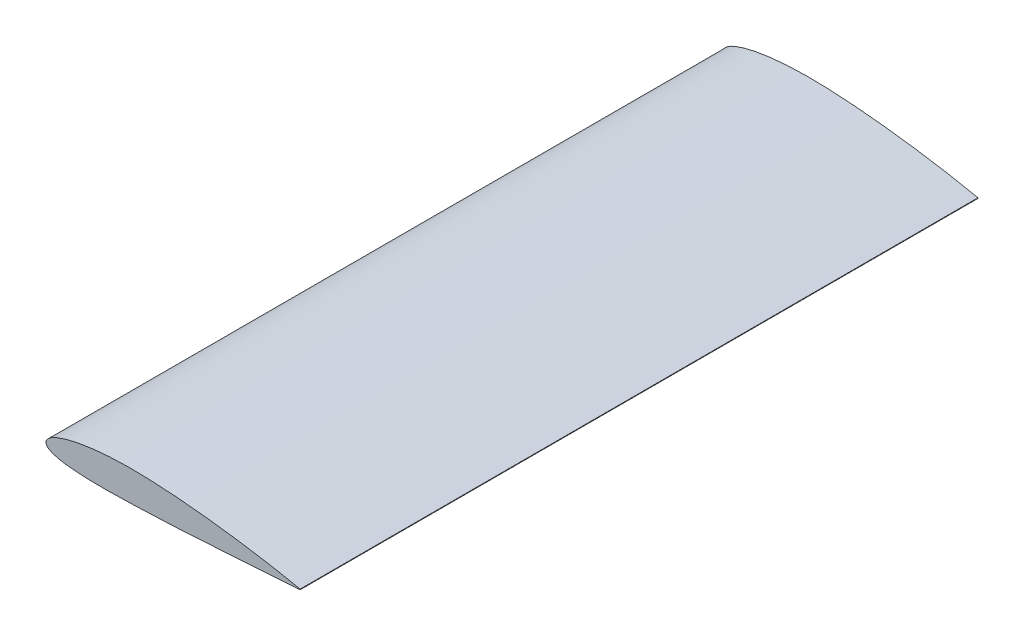
ISO-10303-21;
HEADER;
FILE_DESCRIPTION(('STEP AP214'),'2;1');
FILE_NAME('part.step','',(''),(''),'','','');
FILE_SCHEMA(('AUTOMOTIVE_DESIGN { 1 0 10303 214 1 1 1 1 }'));
ENDSEC;
DATA;
#1=APPLICATION_CONTEXT('core data for automotive mechanical design processes');
#2=APPLICATION_PROTOCOL_DEFINITION('international standard','automotive_design',2000,#1);
#3=PRODUCT_CONTEXT('',#1,'mechanical');
#4=PRODUCT('Part','Part','',(#3));
#5=PRODUCT_RELATED_PRODUCT_CATEGORY('part','',(#4));
#6=PRODUCT_DEFINITION_FORMATION('','',#4);
#7=PRODUCT_DEFINITION_CONTEXT('part definition',#1,'design');
#8=PRODUCT_DEFINITION('design','',#6,#7);
#9=PRODUCT_DEFINITION_SHAPE('','',#8);
#10=(LENGTH_UNIT() NAMED_UNIT(*) SI_UNIT(.MILLI.,.METRE.));
#11=(NAMED_UNIT(*) PLANE_ANGLE_UNIT() SI_UNIT($,.RADIAN.));
#12=(NAMED_UNIT(*) SI_UNIT($,.STERADIAN.) SOLID_ANGLE_UNIT());
#13=UNCERTAINTY_MEASURE_WITH_UNIT(LENGTH_MEASURE(1.E-05),#10,'distance_accuracy_value','');
#14=(GEOMETRIC_REPRESENTATION_CONTEXT(3) GLOBAL_UNCERTAINTY_ASSIGNED_CONTEXT((#13)) GLOBAL_UNIT_ASSIGNED_CONTEXT((#10,
#11,#12)) REPRESENTATION_CONTEXT('',''));
#15=CARTESIAN_POINT('',(0.,0.,0.));
#16=DIRECTION('',(0.,0.,1.));
#17=DIRECTION('',(1.,0.,0.));
#18=AXIS2_PLACEMENT_3D('',#15,#16,#17);
#19=CARTESIAN_POINT('',(1500.126,1.8855,2000.));
#20=CARTESIAN_POINT('',(1499.36250962682,2.04454622633905,2000.));
#21=CARTESIAN_POINT('',(1496.31288024535,2.6798286894732,2000.));
#22=CARTESIAN_POINT('',(1489.46815435767,4.10050468112612,2000.));
#23=CARTESIAN_POINT('',(1478.10424528291,6.43882842560711,2000.));
#24=CARTESIAN_POINT('',(1462.28588160738,9.64872347621278,2000.));
#25=CARTESIAN_POINT('',(1442.10650015217,13.6770674132571,2000.));
#26=CARTESIAN_POINT('',(1417.68261613177,18.4488091632932,2000.));
#27=CARTESIAN_POINT('',(1389.15763680456,23.8816251229395,2000.));
#28=CARTESIAN_POINT('',(1356.69951059212,29.8872262769183,2000.));
#29=CARTESIAN_POINT('',(1320.49931464965,36.3633785840388,2000.));
#30=CARTESIAN_POINT('',(1280.77334318009,43.2092253702978,2000.));
#31=CARTESIAN_POINT('',(1237.75828325618,50.3211496049656,2000.));
#32=CARTESIAN_POINT('',(1191.71219612801,57.5897056804869,2000.));
#33=CARTESIAN_POINT('',(1142.91266888195,64.9079515766165,2000.));
#34=CARTESIAN_POINT('',(1091.65650349491,72.1707843166536,2000.));
#35=CARTESIAN_POINT('',(1038.25529393639,79.2693300204012,2000.));
#36=CARTESIAN_POINT('',(983.03553107897,86.0985567611147,2000.));
#37=CARTESIAN_POINT('',(926.33636880365,92.560783205146,2000.));
#38=CARTESIAN_POINT('',(868.506926853019,98.5429145839118,2000.));
#39=CARTESIAN_POINT('',(809.905975550599,103.957990528865,2000.));
#40=CARTESIAN_POINT('',(750.897541128017,108.696716695938,2000.));
#41=CARTESIAN_POINT('',(691.850901200093,112.681641218205,2000.));
#42=CARTESIAN_POINT('',(633.068914466651,115.81851544224,2000.));
#43=CARTESIAN_POINT('',(574.833601038095,118.066588320636,2000.));
#44=CARTESIAN_POINT('',(517.503711060707,119.012387706689,2000.));
#45=CARTESIAN_POINT('',(461.524793157148,118.648451294734,2000.));
#46=CARTESIAN_POINT('',(407.352172284395,116.966390015056,2000.));
#47=CARTESIAN_POINT('',(355.343945044189,113.986576207201,2000.));
#48=CARTESIAN_POINT('',(305.84413727598,109.753318192072,2000.));
#49=CARTESIAN_POINT('',(259.177510515583,104.341080513298,2000.));
#50=CARTESIAN_POINT('',(215.649043972803,97.8407071880873,2000.));
#51=CARTESIAN_POINT('',(175.537823010593,90.3672176619757,2000.));
#52=CARTESIAN_POINT('',(139.09763354471,82.0473365164192,2000.));
#53=CARTESIAN_POINT('',(106.548459136384,73.030192935871,2000.));
#54=CARTESIAN_POINT('',(78.0829325582604,63.45504798042,2000.));
#55=CARTESIAN_POINT('',(53.8515422411879,53.4740024042939,2000.));
#56=CARTESIAN_POINT('',(33.9672757623426,43.21991095644,2000.));
#57=CARTESIAN_POINT('',(18.479711750421,32.7945575115555,2000.));
#58=CARTESIAN_POINT('',(7.39766611725858,22.219697889601,2000.));
#59=CARTESIAN_POINT('',(0.72828405786883,11.2850634235022,2000.));
#60=CARTESIAN_POINT('',(-0.855204890434571,-0.0856562656846379,2000.));
#61=CARTESIAN_POINT('',(2.94364871135739,-10.9079930101216,2000.));
#62=CARTESIAN_POINT('',(11.576569643456,-20.3167336591665,2000.));
#63=CARTESIAN_POINT('',(24.3854866584761,-28.5551212186186,2000.));
#64=CARTESIAN_POINT('',(41.3662152144666,-35.8908401976582,2000.));
#65=CARTESIAN_POINT('',(62.4903432672211,-42.3613355951814,2000.));
#66=CARTESIAN_POINT('',(87.6694310663393,-47.9739009318134,2000.));
#67=CARTESIAN_POINT('',(116.765810867515,-52.7142643488912,2000.));
#68=CARTESIAN_POINT('',(149.608257760466,-56.5781677335827,2000.));
#69=CARTESIAN_POINT('',(185.999759165816,-59.571815987631,2000.));
#70=CARTESIAN_POINT('',(225.723270872767,-61.7204781489215,2000.));
#71=CARTESIAN_POINT('',(268.544933173449,-63.0584212827457,2000.));
#72=CARTESIAN_POINT('',(314.215134318426,-63.6413844805097,2000.));
#73=CARTESIAN_POINT('',(362.470919865866,-63.5326472315172,2000.));
#74=CARTESIAN_POINT('',(413.036025515734,-62.8184863600194,2000.));
#75=CARTESIAN_POINT('',(465.622461548211,-61.5859086467098,2000.));
#76=CARTESIAN_POINT('',(519.930965328447,-59.9418933830253,2000.));
#77=CARTESIAN_POINT('',(575.737900187506,-57.9730664551327,2000.));
#78=CARTESIAN_POINT('',(632.789188170888,-55.8168682092319,2000.));
#79=CARTESIAN_POINT('',(690.733841298208,-53.2093805531331,2000.));
#80=CARTESIAN_POINT('',(749.136590231138,-50.2811184304566,2000.));
#81=CARTESIAN_POINT('',(807.576269289216,-47.0958967176524,2000.));
#82=CARTESIAN_POINT('',(865.698253904019,-43.7442190530985,2000.));
#83=CARTESIAN_POINT('',(923.14764670139,-40.2870260023377,2000.));
#84=CARTESIAN_POINT('',(979.57196289439,-36.791814269145,2000.));
#85=CARTESIAN_POINT('',(1034.62324764788,-33.3033629804457,2000.));
#86=CARTESIAN_POINT('',(1087.9613119831,-29.8707695196667,2000.));
#87=CARTESIAN_POINT('',(1139.25459981003,-26.5308017112432,2000.));
#88=CARTESIAN_POINT('',(1188.18290674471,-23.3117264468126,2000.));
#89=CARTESIAN_POINT('',(1234.438975863,-20.2431334860114,2000.));
#90=CARTESIAN_POINT('',(1277.73179700143,-17.3413443420543,2000.));
#91=CARTESIAN_POINT('',(1317.78740579745,-14.6353363514213,2000.));
#92=CARTESIAN_POINT('',(1354.35129536344,-12.1385921455329,2000.));
#93=CARTESIAN_POINT('',(1387.1897948908,-9.87497003504055,2000.));
#94=CARTESIAN_POINT('',(1416.0926846422,-7.86077004662549,2000.));
#95=CARTESIAN_POINT('',(1440.87397679908,-6.11524434932716,2000.));
#96=CARTESIAN_POINT('',(1461.37342314015,-4.65992888678914,2000.));
#97=CARTESIAN_POINT('',(1477.45768352389,-3.50655624372057,2000.));
#98=CARTESIAN_POINT('',(1489.02219751614,-2.67423018259785,2000.));
#99=CARTESIAN_POINT('',(1495.99101195908,-2.16766449957127,2000.));
#100=CARTESIAN_POINT('',(1499.09649989197,-1.94199848173293,2000.));
#101=CARTESIAN_POINT('',(1499.874,-1.8855,2000.));
#102=B_SPLINE_CURVE_WITH_KNOTS('',3,(#19,#20,#21,#22,#23,#24,#25,#26,#27,#28,#29,#30,#31,#32,
#33,#34,#35,#36,#37,#38,#39,#40,#41,#42,#43,#44,#45,#46,#47,#48,#49,#50,#51,#52,#53,#54,#55,#56,
#57,#58,#59,#60,#61,#62,#63,#64,#65,#66,#67,#68,#69,#70,#71,#72,#73,#74,#75,#76,#77,#78,#79,#80,
#81,#82,#83,#84,#85,#86,#87,#88,#89,#90,#91,#92,#93,#94,#95,#96,#97,#98,#99,#100,#101),
.UNSPECIFIED.,.F.,.F.,(4,1,1,1,1,1,1,1,1,1,1,1,1,1,1,1,1,1,1,1,1,1,1,1,1,1,1,1,1,1,1,1,1,1,1,1,
1,1,1,1,1,1,1,1,1,1,1,1,1,1,1,1,1,1,1,1,1,1,1,1,1,1,1,1,1,1,1,1,1,1,1,1,1,1,1,1,1,1,1,1,4),(0.,
0.000764172441533832,0.00305235378475402,0.0068498057048212,0.0121324733985665,
0.0188679915200488,0.0270128393038131,0.0365168120832152,0.047320748010187,0.0593568710051226,
0.0725508051219635,0.0868200523054509,0.102077397543794,0.118227703036746,0.135170889253622,
0.152802297170214,0.171012918486622,0.189689890020379,0.2087182097852,0.227978894661609,
0.247353901281394,0.266722824804597,0.285966042812018,0.305032180166146,0.323824436620937,
0.342143816816601,0.359879710568798,0.376925817718279,0.393181852747689,0.408552719103573,
0.422951452754657,0.436298148768816,0.448522824449468,0.459565427988144,0.469379445279197,
0.477933615883346,0.48522033832909,0.491267538221565,0.49616782391953,0.500133390493784,
0.503587222302178,0.507040596825175,0.511000027817938,0.515876124661788,0.521872238721079,
0.529071214980825,0.537494990853372,0.547131181284723,0.557945450904502,0.569889642117144,
0.582904388224719,0.59692167175937,0.611866369391749,0.627656322240657,0.644204240139434,
0.661417059233681,0.679197208253312,0.697442956346586,0.716133922541477,0.735139063012098,
0.754277540168221,0.773432072201266,0.792486536790152,0.811323415788077,0.829826150136362,
0.847880343752471,0.865374072591972,0.882198024915322,0.898246949642392,0.91342054427208,
0.927622056045171,0.940762976250731,0.952758837637558,0.963532927047773,0.973016417754069,
0.981148267698661,0.987875251513711,0.993153530447754,0.996949037264165,0.999236150998499,1.),.UNSPECIFIED.);
#103=DIRECTION('',(0.,0.,-1.));
#104=VECTOR('',#103,1.);
#105=SURFACE_OF_LINEAR_EXTRUSION('',#102,#104);
#106=CARTESIAN_POINT('',(1500.126,1.8855,-2000.));
#107=CARTESIAN_POINT('',(1499.36250962682,2.04454622633905,-2000.));
#108=CARTESIAN_POINT('',(1496.31288024535,2.6798286894732,-2000.));
#109=CARTESIAN_POINT('',(1489.46815435767,4.10050468112612,-2000.));
#110=CARTESIAN_POINT('',(1478.10424528291,6.43882842560711,-2000.));
#111=CARTESIAN_POINT('',(1462.28588160738,9.64872347621278,-2000.));
#112=CARTESIAN_POINT('',(1442.10650015217,13.6770674132571,-2000.));
#113=CARTESIAN_POINT('',(1417.68261613177,18.4488091632932,-2000.));
#114=CARTESIAN_POINT('',(1389.15763680456,23.8816251229395,-2000.));
#115=CARTESIAN_POINT('',(1356.69951059212,29.8872262769183,-2000.));
#116=CARTESIAN_POINT('',(1320.49931464965,36.3633785840388,-2000.));
#117=CARTESIAN_POINT('',(1280.77334318009,43.2092253702978,-2000.));
#118=CARTESIAN_POINT('',(1237.75828325618,50.3211496049656,-2000.));
#119=CARTESIAN_POINT('',(1191.71219612801,57.5897056804869,-2000.));
#120=CARTESIAN_POINT('',(1142.91266888195,64.9079515766165,-2000.));
#121=CARTESIAN_POINT('',(1091.65650349491,72.1707843166536,-2000.));
#122=CARTESIAN_POINT('',(1038.25529393639,79.2693300204012,-2000.));
#123=CARTESIAN_POINT('',(983.03553107897,86.0985567611147,-2000.));
#124=CARTESIAN_POINT('',(926.33636880365,92.560783205146,-2000.));
#125=CARTESIAN_POINT('',(868.506926853019,98.5429145839118,-2000.));
#126=CARTESIAN_POINT('',(809.905975550599,103.957990528865,-2000.));
#127=CARTESIAN_POINT('',(750.897541128017,108.696716695938,-2000.));
#128=CARTESIAN_POINT('',(691.850901200093,112.681641218205,-2000.));
#129=CARTESIAN_POINT('',(633.068914466651,115.81851544224,-2000.));
#130=CARTESIAN_POINT('',(574.833601038095,118.066588320636,-2000.));
#131=CARTESIAN_POINT('',(517.503711060707,119.012387706689,-2000.));
#132=CARTESIAN_POINT('',(461.524793157148,118.648451294734,-2000.));
#133=CARTESIAN_POINT('',(407.352172284395,116.966390015056,-2000.));
#134=CARTESIAN_POINT('',(355.343945044189,113.986576207201,-2000.));
#135=CARTESIAN_POINT('',(305.84413727598,109.753318192072,-2000.));
#136=CARTESIAN_POINT('',(259.177510515583,104.341080513298,-2000.));
#137=CARTESIAN_POINT('',(215.649043972803,97.8407071880873,-2000.));
#138=CARTESIAN_POINT('',(175.537823010593,90.3672176619757,-2000.));
#139=CARTESIAN_POINT('',(139.09763354471,82.0473365164192,-2000.));
#140=CARTESIAN_POINT('',(106.548459136384,73.030192935871,-2000.));
#141=CARTESIAN_POINT('',(78.0829325582604,63.45504798042,-2000.));
#142=CARTESIAN_POINT('',(53.8515422411879,53.4740024042939,-2000.));
#143=CARTESIAN_POINT('',(33.9672757623426,43.21991095644,-2000.));
#144=CARTESIAN_POINT('',(18.479711750421,32.7945575115555,-2000.));
#145=CARTESIAN_POINT('',(7.39766611725858,22.219697889601,-2000.));
#146=CARTESIAN_POINT('',(0.72828405786883,11.2850634235022,-2000.));
#147=CARTESIAN_POINT('',(-0.855204890434571,-0.0856562656846379,-2000.));
#148=CARTESIAN_POINT('',(2.94364871135739,-10.9079930101216,-2000.));
#149=CARTESIAN_POINT('',(11.576569643456,-20.3167336591665,-2000.));
#150=CARTESIAN_POINT('',(24.3854866584761,-28.5551212186186,-2000.));
#151=CARTESIAN_POINT('',(41.3662152144666,-35.8908401976582,-2000.));
#152=CARTESIAN_POINT('',(62.4903432672211,-42.3613355951814,-2000.));
#153=CARTESIAN_POINT('',(87.6694310663393,-47.9739009318134,-2000.));
#154=CARTESIAN_POINT('',(116.765810867515,-52.7142643488912,-2000.));
#155=CARTESIAN_POINT('',(149.608257760466,-56.5781677335827,-2000.));
#156=CARTESIAN_POINT('',(185.999759165816,-59.571815987631,-2000.));
#157=CARTESIAN_POINT('',(225.723270872767,-61.7204781489215,-2000.));
#158=CARTESIAN_POINT('',(268.544933173449,-63.0584212827457,-2000.));
#159=CARTESIAN_POINT('',(314.215134318426,-63.6413844805097,-2000.));
#160=CARTESIAN_POINT('',(362.470919865866,-63.5326472315172,-2000.));
#161=CARTESIAN_POINT('',(413.036025515734,-62.8184863600194,-2000.));
#162=CARTESIAN_POINT('',(465.622461548211,-61.5859086467098,-2000.));
#163=CARTESIAN_POINT('',(519.930965328447,-59.9418933830253,-2000.));
#164=CARTESIAN_POINT('',(575.737900187506,-57.9730664551327,-2000.));
#165=CARTESIAN_POINT('',(632.789188170888,-55.8168682092319,-2000.));
#166=CARTESIAN_POINT('',(690.733841298208,-53.2093805531331,-2000.));
#167=CARTESIAN_POINT('',(749.136590231138,-50.2811184304566,-2000.));
#168=CARTESIAN_POINT('',(807.576269289216,-47.0958967176524,-2000.));
#169=CARTESIAN_POINT('',(865.698253904019,-43.7442190530985,-2000.));
#170=CARTESIAN_POINT('',(923.14764670139,-40.2870260023377,-2000.));
#171=CARTESIAN_POINT('',(979.57196289439,-36.791814269145,-2000.));
#172=CARTESIAN_POINT('',(1034.62324764788,-33.3033629804457,-2000.));
#173=CARTESIAN_POINT('',(1087.9613119831,-29.8707695196667,-2000.));
#174=CARTESIAN_POINT('',(1139.25459981003,-26.5308017112432,-2000.));
#175=CARTESIAN_POINT('',(1188.18290674471,-23.3117264468126,-2000.));
#176=CARTESIAN_POINT('',(1234.438975863,-20.2431334860114,-2000.));
#177=CARTESIAN_POINT('',(1277.73179700143,-17.3413443420543,-2000.));
#178=CARTESIAN_POINT('',(1317.78740579745,-14.6353363514213,-2000.));
#179=CARTESIAN_POINT('',(1354.35129536344,-12.1385921455329,-2000.));
#180=CARTESIAN_POINT('',(1387.1897948908,-9.87497003504055,-2000.));
#181=CARTESIAN_POINT('',(1416.0926846422,-7.86077004662549,-2000.));
#182=CARTESIAN_POINT('',(1440.87397679908,-6.11524434932716,-2000.));
#183=CARTESIAN_POINT('',(1461.37342314015,-4.65992888678914,-2000.));
#184=CARTESIAN_POINT('',(1477.45768352389,-3.50655624372057,-2000.));
#185=CARTESIAN_POINT('',(1489.02219751614,-2.67423018259785,-2000.));
#186=CARTESIAN_POINT('',(1495.99101195908,-2.16766449957127,-2000.));
#187=CARTESIAN_POINT('',(1499.09649989197,-1.94199848173293,-2000.));
#188=CARTESIAN_POINT('',(1499.874,-1.8855,-2000.));
#189=B_SPLINE_CURVE_WITH_KNOTS('',3,(#106,#107,#108,#109,#110,#111,#112,#113,#114,#115,#116,
#117,#118,#119,#120,#121,#122,#123,#124,#125,#126,#127,#128,#129,#130,#131,#132,#133,#134,#135,
#136,#137,#138,#139,#140,#141,#142,#143,#144,#145,#146,#147,#148,#149,#150,#151,#152,#153,#154,
#155,#156,#157,#158,#159,#160,#161,#162,#163,#164,#165,#166,#167,#168,#169,#170,#171,#172,#173,
#174,#175,#176,#177,#178,#179,#180,#181,#182,#183,#184,#185,#186,#187,#188),.UNSPECIFIED.,.F.,
.F.,(4,1,1,1,1,1,1,1,1,1,1,1,1,1,1,1,1,1,1,1,1,1,1,1,1,1,1,1,1,1,1,1,1,1,1,1,1,1,1,1,1,1,1,1,1,
1,1,1,1,1,1,1,1,1,1,1,1,1,1,1,1,1,1,1,1,1,1,1,1,1,1,1,1,1,1,1,1,1,1,1,4),(0.,
0.000764172441533832,0.00305235378475402,0.0068498057048212,0.0121324733985665,
0.0188679915200488,0.0270128393038131,0.0365168120832152,0.047320748010187,0.0593568710051226,
0.0725508051219635,0.0868200523054509,0.102077397543794,0.118227703036746,0.135170889253622,
0.152802297170214,0.171012918486622,0.189689890020379,0.2087182097852,0.227978894661609,
0.247353901281394,0.266722824804597,0.285966042812018,0.305032180166146,0.323824436620937,
0.342143816816601,0.359879710568798,0.376925817718279,0.393181852747689,0.408552719103573,
0.422951452754657,0.436298148768816,0.448522824449468,0.459565427988144,0.469379445279197,
0.477933615883346,0.48522033832909,0.491267538221565,0.49616782391953,0.500133390493784,
0.503587222302178,0.507040596825175,0.511000027817938,0.515876124661788,0.521872238721079,
0.529071214980825,0.537494990853372,0.547131181284723,0.557945450904502,0.569889642117144,
0.582904388224719,0.59692167175937,0.611866369391749,0.627656322240657,0.644204240139434,
0.661417059233681,0.679197208253312,0.697442956346586,0.716133922541477,0.735139063012098,
0.754277540168221,0.773432072201266,0.792486536790152,0.811323415788077,0.829826150136362,
0.847880343752471,0.865374072591972,0.882198024915322,0.898246949642392,0.91342054427208,
0.927622056045171,0.940762976250731,0.952758837637558,0.963532927047773,0.973016417754069,
0.981148267698661,0.987875251513711,0.993153530447754,0.996949037264165,0.999236150998499,1.),.UNSPECIFIED.);
#190=CARTESIAN_POINT('',(1500.126,1.8855,-2000.));
#191=VERTEX_POINT('',#190);
#192=CARTESIAN_POINT('',(1499.874,-1.8855,-2000.));
#193=VERTEX_POINT('',#192);
#194=EDGE_CURVE('E69',#191,#193,#189,.T.);
#195=ORIENTED_EDGE('',*,*,#194,.T.);
#196=DIRECTION('',(0.,0.,-1.));
#197=VECTOR('',#196,1.);
#198=CARTESIAN_POINT('',(1499.874,-1.8855,2000.));
#199=LINE('',#198,#197);
#200=CARTESIAN_POINT('',(1499.874,-1.8855,2000.));
#201=VERTEX_POINT('',#200);
#202=EDGE_CURVE('E11',#201,#193,#199,.T.);
#203=ORIENTED_EDGE('',*,*,#202,.F.);
#204=CARTESIAN_POINT('',(1500.126,1.8855,2000.));
#205=VERTEX_POINT('',#204);
#206=EDGE_CURVE('E68',#205,#201,#102,.T.);
#207=ORIENTED_EDGE('',*,*,#206,.F.);
#208=DIRECTION('',(0.,0.,-1.));
#209=VECTOR('',#208,1.);
#210=CARTESIAN_POINT('',(1500.126,1.8855,2000.));
#211=LINE('',#210,#209);
#212=EDGE_CURVE('E46',#205,#191,#211,.T.);
#213=ORIENTED_EDGE('',*,*,#212,.T.);
#214=EDGE_LOOP('',(#195,#203,#207,#213));
#215=FACE_BOUND('',#214,.T.);
#216=ADVANCED_FACE('F37',(#215),#105,.F.);
#217=CARTESIAN_POINT('',(1499.874,-1.8855,2000.));
#218=DIRECTION('',(-0.997774608508291,0.0666770621437894,0.));
#219=DIRECTION('',(-0.0666770621437894,-0.997774608508291,0.));
#220=AXIS2_PLACEMENT_3D('',#217,#218,#219);
#221=PLANE('',#220);
#222=DIRECTION('',(0.0666770621437894,0.997774608508291,0.));
#223=VECTOR('',#222,1.);
#224=CARTESIAN_POINT('',(1499.874,-1.8855,-2000.));
#225=LINE('',#224,#223);
#226=EDGE_CURVE('E61',#193,#191,#225,.T.);
#227=ORIENTED_EDGE('',*,*,#226,.T.);
#228=ORIENTED_EDGE('',*,*,#212,.F.);
#229=DIRECTION('',(0.0666770621437894,0.997774608508291,0.));
#230=VECTOR('',#229,1.);
#231=CARTESIAN_POINT('',(1499.874,-1.8855,2000.));
#232=LINE('',#231,#230);
#233=EDGE_CURVE('E53',#201,#205,#232,.T.);
#234=ORIENTED_EDGE('',*,*,#233,.F.);
#235=ORIENTED_EDGE('',*,*,#202,.T.);
#236=EDGE_LOOP('',(#227,#228,#234,#235));
#237=FACE_BOUND('',#236,.T.);
#238=ADVANCED_FACE('F64',(#237),#221,.F.);
#239=CARTESIAN_POINT('',(1.42482607138895,10.8833860600066,2000.));
#240=DIRECTION('',(0.,0.,-1.));
#241=DIRECTION('',(-1.,0.,0.));
#242=AXIS2_PLACEMENT_3D('',#239,#240,#241);
#243=PLANE('',#242);
#244=ORIENTED_EDGE('',*,*,#206,.T.);
#245=ORIENTED_EDGE('',*,*,#233,.T.);
#246=EDGE_LOOP('',(#244,#245));
#247=FACE_BOUND('',#246,.T.);
#248=ADVANCED_FACE('F86',(#247),#243,.F.);
#249=CARTESIAN_POINT('',(1.42482607138895,10.8833860600066,-2000.));
#250=DIRECTION('',(0.,0.,-1.));
#251=DIRECTION('',(-1.,0.,0.));
#252=AXIS2_PLACEMENT_3D('',#249,#250,#251);
#253=PLANE('',#252);
#254=ORIENTED_EDGE('',*,*,#194,.F.);
#255=ORIENTED_EDGE('',*,*,#226,.F.);
#256=EDGE_LOOP('',(#254,#255));
#257=FACE_BOUND('',#256,.T.);
#258=ADVANCED_FACE('F72',(#257),#253,.T.);
#259=CLOSED_SHELL('',(#216,#238,#248,#258));
#260=MANIFOLD_SOLID_BREP('B2',#259);
#261=ADVANCED_BREP_SHAPE_REPRESENTATION('',(#18,#260),#14);
#262=SHAPE_DEFINITION_REPRESENTATION(#9,#261);
ENDSEC;
END-ISO-10303-21;
